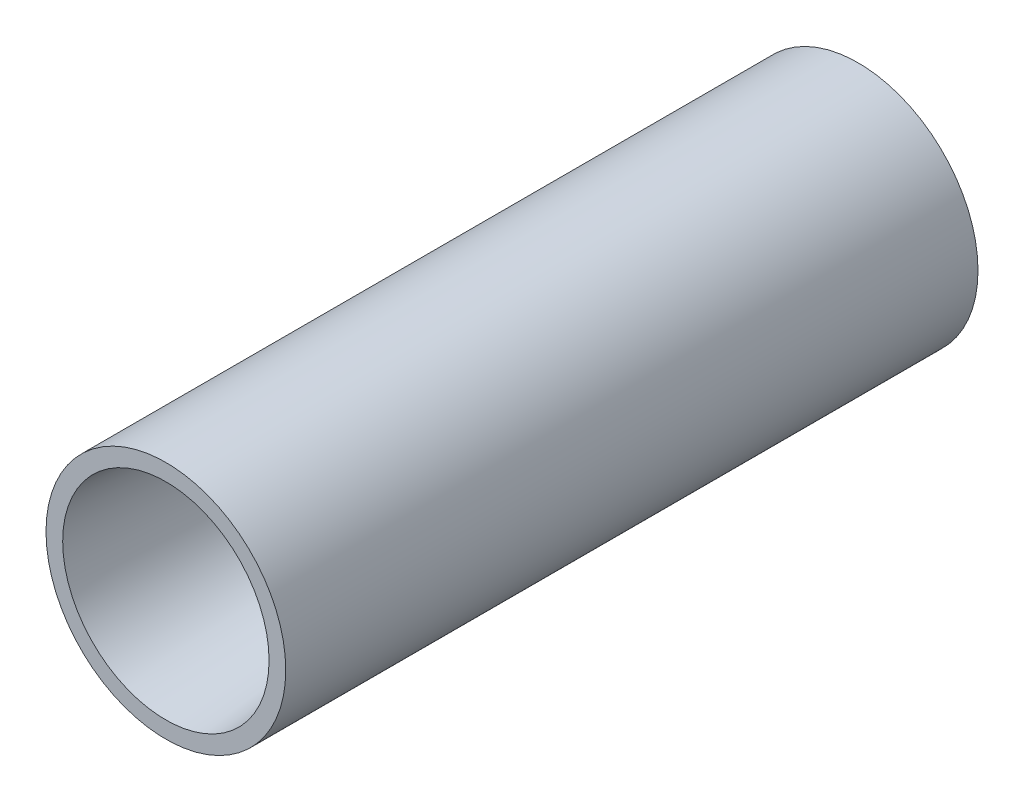
ISO-10303-21;
HEADER;
FILE_DESCRIPTION(('STEP AP214'),'2;1');
FILE_NAME('part.step','',(''),(''),'','','');
FILE_SCHEMA(('AUTOMOTIVE_DESIGN { 1 0 10303 214 1 1 1 1 }'));
ENDSEC;
DATA;
#1=APPLICATION_CONTEXT('core data for automotive mechanical design processes');
#2=APPLICATION_PROTOCOL_DEFINITION('international standard','automotive_design',2000,#1);
#3=PRODUCT_CONTEXT('',#1,'mechanical');
#4=PRODUCT('Part','Part','',(#3));
#5=PRODUCT_RELATED_PRODUCT_CATEGORY('part','',(#4));
#6=PRODUCT_DEFINITION_FORMATION('','',#4);
#7=PRODUCT_DEFINITION_CONTEXT('part definition',#1,'design');
#8=PRODUCT_DEFINITION('design','',#6,#7);
#9=PRODUCT_DEFINITION_SHAPE('','',#8);
#10=(LENGTH_UNIT() NAMED_UNIT(*) SI_UNIT(.MILLI.,.METRE.));
#11=(NAMED_UNIT(*) PLANE_ANGLE_UNIT() SI_UNIT($,.RADIAN.));
#12=(NAMED_UNIT(*) SI_UNIT($,.STERADIAN.) SOLID_ANGLE_UNIT());
#13=UNCERTAINTY_MEASURE_WITH_UNIT(LENGTH_MEASURE(1.E-05),#10,'distance_accuracy_value','');
#14=(GEOMETRIC_REPRESENTATION_CONTEXT(3) GLOBAL_UNCERTAINTY_ASSIGNED_CONTEXT((#13)) GLOBAL_UNIT_ASSIGNED_CONTEXT((#10,
#11,#12)) REPRESENTATION_CONTEXT('',''));
#15=CARTESIAN_POINT('',(0.,0.,0.));
#16=DIRECTION('',(0.,0.,1.));
#17=DIRECTION('',(1.,0.,0.));
#18=AXIS2_PLACEMENT_3D('',#15,#16,#17);
#19=CARTESIAN_POINT('',(0.,0.,70.));
#20=DIRECTION('',(0.,0.,-1.));
#21=DIRECTION('',(-1.,0.,0.));
#22=AXIS2_PLACEMENT_3D('',#19,#20,#21);
#23=CYLINDRICAL_SURFACE('',#22,12.1219295580671);
#24=CARTESIAN_POINT('',(0.,0.,70.));
#25=DIRECTION('',(0.,0.,1.));
#26=DIRECTION('',(1.,0.,0.));
#27=AXIS2_PLACEMENT_3D('',#24,#25,#26);
#28=CIRCLE('',#27,12.1219295580671);
#29=CARTESIAN_POINT('',(12.1219295580671,0.,70.));
#30=VERTEX_POINT('',#29);
#31=EDGE_CURVE('E53',#30,#30,#28,.T.);
#32=ORIENTED_EDGE('',*,*,#31,.F.);
#33=EDGE_LOOP('',(#32));
#34=FACE_BOUND('',#33,.T.);
#35=CARTESIAN_POINT('',(0.,0.,0.));
#36=DIRECTION('',(0.,0.,1.));
#37=DIRECTION('',(1.,0.,0.));
#38=AXIS2_PLACEMENT_3D('',#35,#36,#37);
#39=CIRCLE('',#38,12.1219295580671);
#40=CARTESIAN_POINT('',(12.1219295580671,0.,0.));
#41=VERTEX_POINT('',#40);
#42=EDGE_CURVE('E58',#41,#41,#39,.T.);
#43=ORIENTED_EDGE('',*,*,#42,.T.);
#44=EDGE_LOOP('',(#43));
#45=FACE_BOUND('',#44,.T.);
#46=ADVANCED_FACE('F39',(#34,#45),#23,.T.);
#47=CARTESIAN_POINT('',(0.,0.,70.));
#48=DIRECTION('',(0.,0.,1.));
#49=DIRECTION('',(1.,0.,0.));
#50=AXIS2_PLACEMENT_3D('',#47,#48,#49);
#51=PLANE('',#50);
#52=CARTESIAN_POINT('',(0.,0.,70.));
#53=DIRECTION('',(0.,0.,1.));
#54=DIRECTION('',(1.,0.,0.));
#55=AXIS2_PLACEMENT_3D('',#52,#53,#54);
#56=CIRCLE('',#55,10.4353625466021);
#57=CARTESIAN_POINT('',(10.4353625466021,0.,70.));
#58=VERTEX_POINT('',#57);
#59=EDGE_CURVE('E10',#58,#58,#56,.F.);
#60=ORIENTED_EDGE('',*,*,#59,.T.);
#61=EDGE_LOOP('',(#60));
#62=FACE_BOUND('',#61,.T.);
#63=ORIENTED_EDGE('',*,*,#31,.T.);
#64=EDGE_LOOP('',(#63));
#65=FACE_BOUND('',#64,.T.);
#66=ADVANCED_FACE('F80',(#62,#65),#51,.T.);
#67=CARTESIAN_POINT('',(0.,0.,0.));
#68=DIRECTION('',(0.,0.,1.));
#69=DIRECTION('',(1.,0.,0.));
#70=AXIS2_PLACEMENT_3D('',#67,#68,#69);
#71=PLANE('',#70);
#72=ORIENTED_EDGE('',*,*,#42,.F.);
#73=EDGE_LOOP('',(#72));
#74=FACE_BOUND('',#73,.T.);
#75=ADVANCED_FACE('F73',(#74),#71,.F.);
#76=CARTESIAN_POINT('',(0.,0.,10.));
#77=DIRECTION('',(0.,0.,1.));
#78=DIRECTION('',(1.,0.,0.));
#79=AXIS2_PLACEMENT_3D('',#76,#77,#78);
#80=CYLINDRICAL_SURFACE('',#79,6.43536254660225);
#81=CARTESIAN_POINT('',(0.,0.,24.2797907889564));
#82=DIRECTION('',(0.,0.,1.));
#83=DIRECTION('',(1.,0.,0.));
#84=AXIS2_PLACEMENT_3D('',#81,#82,#83);
#85=CIRCLE('',#84,6.43536254660225);
#86=CARTESIAN_POINT('',(6.43536254660225,0.,24.2797907889564));
#87=VERTEX_POINT('',#86);
#88=EDGE_CURVE('E48',#87,#87,#85,.T.);
#89=ORIENTED_EDGE('',*,*,#88,.T.);
#90=EDGE_LOOP('',(#89));
#91=FACE_BOUND('',#90,.T.);
#92=CARTESIAN_POINT('',(0.,0.,10.));
#93=DIRECTION('',(0.,0.,1.));
#94=DIRECTION('',(1.,0.,0.));
#95=AXIS2_PLACEMENT_3D('',#92,#93,#94);
#96=CIRCLE('',#95,6.43536254660225);
#97=CARTESIAN_POINT('',(6.43536254660225,0.,10.));
#98=VERTEX_POINT('',#97);
#99=EDGE_CURVE('E63',#98,#98,#96,.T.);
#100=ORIENTED_EDGE('',*,*,#99,.F.);
#101=EDGE_LOOP('',(#100));
#102=FACE_BOUND('',#101,.T.);
#103=ADVANCED_FACE('F71',(#91,#102),#80,.F.);
#104=CARTESIAN_POINT('',(0.,0.,10.));
#105=DIRECTION('',(0.,0.,1.));
#106=DIRECTION('',(1.,0.,0.));
#107=AXIS2_PLACEMENT_3D('',#104,#105,#106);
#108=PLANE('',#107);
#109=ORIENTED_EDGE('',*,*,#99,.T.);
#110=EDGE_LOOP('',(#109));
#111=FACE_BOUND('',#110,.T.);
#112=ADVANCED_FACE('F69',(#111),#108,.T.);
#113=CARTESIAN_POINT('',(0.,0.,24.2797907889564));
#114=DIRECTION('',(0.,0.,1.));
#115=DIRECTION('',(1.,0.,0.));
#116=AXIS2_PLACEMENT_3D('',#113,#114,#115);
#117=CONICAL_SURFACE('',#116,6.43536254660225,0.0872664625997168);
#118=ORIENTED_EDGE('',*,*,#59,.F.);
#119=EDGE_LOOP('',(#118));
#120=FACE_BOUND('',#119,.T.);
#121=ORIENTED_EDGE('',*,*,#88,.F.);
#122=EDGE_LOOP('',(#121));
#123=FACE_BOUND('',#122,.T.);
#124=ADVANCED_FACE('F42',(#120,#123),#117,.F.);
#125=CLOSED_SHELL('',(#46,#66,#75,#103,#112,#124));
#126=MANIFOLD_SOLID_BREP('B2',#125);
#127=ADVANCED_BREP_SHAPE_REPRESENTATION('',(#18,#126),#14);
#128=SHAPE_DEFINITION_REPRESENTATION(#9,#127);
ENDSEC;
END-ISO-10303-21;
